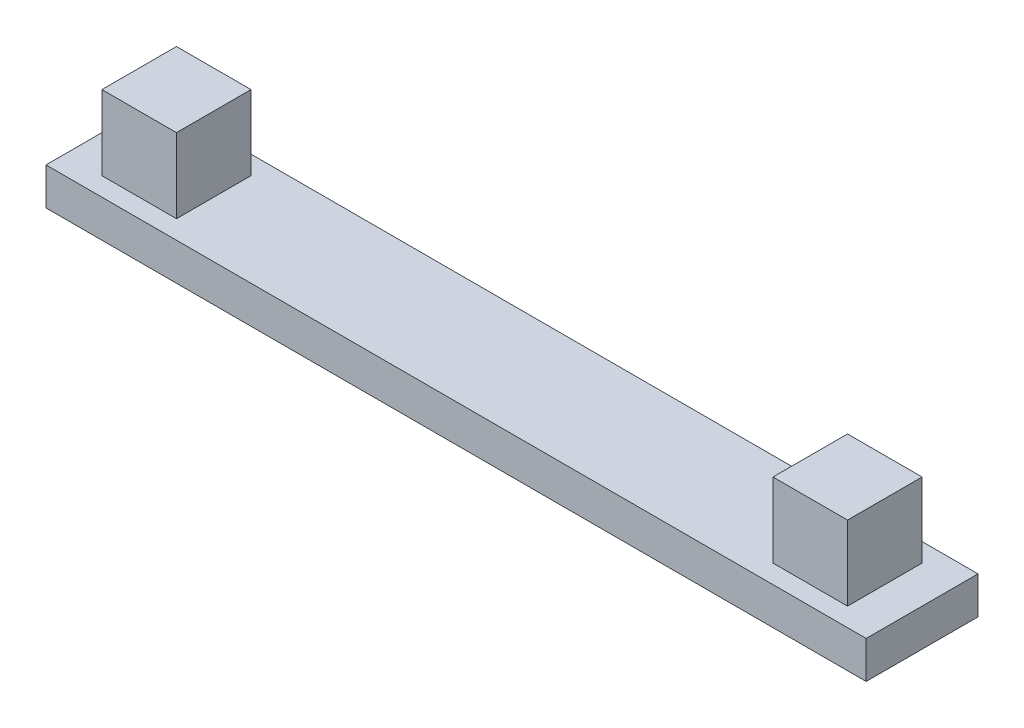
ISO-10303-21;
HEADER;
FILE_DESCRIPTION(('STEP AP214'),'2;1');
FILE_NAME('part.step','',(''),(''),'','','');
FILE_SCHEMA(('AUTOMOTIVE_DESIGN { 1 0 10303 214 1 1 1 1 }'));
ENDSEC;
DATA;
#1=APPLICATION_CONTEXT('core data for automotive mechanical design processes');
#2=APPLICATION_PROTOCOL_DEFINITION('international standard','automotive_design',2000,#1);
#3=PRODUCT_CONTEXT('',#1,'mechanical');
#4=PRODUCT('Part','Part','',(#3));
#5=PRODUCT_RELATED_PRODUCT_CATEGORY('part','',(#4));
#6=PRODUCT_DEFINITION_FORMATION('','',#4);
#7=PRODUCT_DEFINITION_CONTEXT('part definition',#1,'design');
#8=PRODUCT_DEFINITION('design','',#6,#7);
#9=PRODUCT_DEFINITION_SHAPE('','',#8);
#10=(LENGTH_UNIT() NAMED_UNIT(*) SI_UNIT(.MILLI.,.METRE.));
#11=(NAMED_UNIT(*) PLANE_ANGLE_UNIT() SI_UNIT($,.RADIAN.));
#12=(NAMED_UNIT(*) SI_UNIT($,.STERADIAN.) SOLID_ANGLE_UNIT());
#13=UNCERTAINTY_MEASURE_WITH_UNIT(LENGTH_MEASURE(1.E-05),#10,'distance_accuracy_value','');
#14=(GEOMETRIC_REPRESENTATION_CONTEXT(3) GLOBAL_UNCERTAINTY_ASSIGNED_CONTEXT((#13)) GLOBAL_UNIT_ASSIGNED_CONTEXT((#10,
#11,#12)) REPRESENTATION_CONTEXT('',''));
#15=CARTESIAN_POINT('',(0.,0.,0.));
#16=DIRECTION('',(0.,0.,1.));
#17=DIRECTION('',(1.,0.,0.));
#18=AXIS2_PLACEMENT_3D('',#15,#16,#17);
#19=CARTESIAN_POINT('',(0.,1.,0.));
#20=DIRECTION('',(0.,0.,-1.));
#21=DIRECTION('',(-1.,0.,0.));
#22=AXIS2_PLACEMENT_3D('',#19,#20,#21);
#23=PLANE('',#22);
#24=DIRECTION('',(1.,0.,0.));
#25=VECTOR('',#24,1.);
#26=CARTESIAN_POINT('',(0.,0.,0.));
#27=LINE('',#26,#25);
#28=CARTESIAN_POINT('',(0.,0.,0.));
#29=VERTEX_POINT('',#28);
#30=CARTESIAN_POINT('',(22.,0.,0.));
#31=VERTEX_POINT('',#30);
#32=EDGE_CURVE('E136',#29,#31,#27,.T.);
#33=ORIENTED_EDGE('',*,*,#32,.T.);
#34=DIRECTION('',(0.,-1.,0.));
#35=VECTOR('',#34,1.);
#36=CARTESIAN_POINT('',(22.,1.,0.));
#37=LINE('',#36,#35);
#38=CARTESIAN_POINT('',(22.,1.,0.));
#39=VERTEX_POINT('',#38);
#40=EDGE_CURVE('E11',#39,#31,#37,.T.);
#41=ORIENTED_EDGE('',*,*,#40,.F.);
#42=DIRECTION('',(1.,0.,0.));
#43=VECTOR('',#42,1.);
#44=CARTESIAN_POINT('',(0.,1.,0.));
#45=LINE('',#44,#43);
#46=CARTESIAN_POINT('',(0.,1.,0.));
#47=VERTEX_POINT('',#46);
#48=EDGE_CURVE('E101',#47,#39,#45,.T.);
#49=ORIENTED_EDGE('',*,*,#48,.F.);
#50=DIRECTION('',(0.,-1.,0.));
#51=VECTOR('',#50,1.);
#52=CARTESIAN_POINT('',(0.,1.,0.));
#53=LINE('',#52,#51);
#54=EDGE_CURVE('E78',#47,#29,#53,.T.);
#55=ORIENTED_EDGE('',*,*,#54,.T.);
#56=EDGE_LOOP('',(#33,#41,#49,#55));
#57=FACE_BOUND('',#56,.T.);
#58=ADVANCED_FACE('F35',(#57),#23,.F.);
#59=CARTESIAN_POINT('',(22.,1.,0.));
#60=DIRECTION('',(-1.,0.,0.));
#61=DIRECTION('',(0.,0.,1.));
#62=AXIS2_PLACEMENT_3D('',#59,#60,#61);
#63=PLANE('',#62);
#64=DIRECTION('',(0.,0.,-1.));
#65=VECTOR('',#64,1.);
#66=CARTESIAN_POINT('',(22.,0.,0.));
#67=LINE('',#66,#65);
#68=CARTESIAN_POINT('',(22.,0.,-3.));
#69=VERTEX_POINT('',#68);
#70=EDGE_CURVE('E138',#31,#69,#67,.T.);
#71=ORIENTED_EDGE('',*,*,#70,.T.);
#72=DIRECTION('',(0.,-1.,0.));
#73=VECTOR('',#72,1.);
#74=CARTESIAN_POINT('',(22.,1.,-3.));
#75=LINE('',#74,#73);
#76=CARTESIAN_POINT('',(22.,1.,-3.));
#77=VERTEX_POINT('',#76);
#78=EDGE_CURVE('E43',#77,#69,#75,.T.);
#79=ORIENTED_EDGE('',*,*,#78,.F.);
#80=DIRECTION('',(0.,0.,-1.));
#81=VECTOR('',#80,1.);
#82=CARTESIAN_POINT('',(22.,1.,0.));
#83=LINE('',#82,#81);
#84=EDGE_CURVE('E86',#39,#77,#83,.T.);
#85=ORIENTED_EDGE('',*,*,#84,.F.);
#86=ORIENTED_EDGE('',*,*,#40,.T.);
#87=EDGE_LOOP('',(#71,#79,#85,#86));
#88=FACE_BOUND('',#87,.T.);
#89=ADVANCED_FACE('F148',(#88),#63,.F.);
#90=CARTESIAN_POINT('',(0.,1.,-3.));
#91=DIRECTION('',(0.,0.,-1.));
#92=DIRECTION('',(-1.,0.,0.));
#93=AXIS2_PLACEMENT_3D('',#90,#91,#92);
#94=PLANE('',#93);
#95=DIRECTION('',(1.,0.,0.));
#96=VECTOR('',#95,1.);
#97=CARTESIAN_POINT('',(0.,0.,-3.));
#98=LINE('',#97,#96);
#99=CARTESIAN_POINT('',(0.,0.,-3.));
#100=VERTEX_POINT('',#99);
#101=EDGE_CURVE('E142',#100,#69,#98,.T.);
#102=ORIENTED_EDGE('',*,*,#101,.F.);
#103=DIRECTION('',(0.,-1.,0.));
#104=VECTOR('',#103,1.);
#105=CARTESIAN_POINT('',(0.,1.,-3.));
#106=LINE('',#105,#104);
#107=CARTESIAN_POINT('',(0.,1.,-3.));
#108=VERTEX_POINT('',#107);
#109=EDGE_CURVE('E70',#108,#100,#106,.T.);
#110=ORIENTED_EDGE('',*,*,#109,.F.);
#111=DIRECTION('',(1.,0.,0.));
#112=VECTOR('',#111,1.);
#113=CARTESIAN_POINT('',(0.,1.,-3.));
#114=LINE('',#113,#112);
#115=EDGE_CURVE('E108',#108,#77,#114,.T.);
#116=ORIENTED_EDGE('',*,*,#115,.T.);
#117=ORIENTED_EDGE('',*,*,#78,.T.);
#118=EDGE_LOOP('',(#102,#110,#116,#117));
#119=FACE_BOUND('',#118,.T.);
#120=ADVANCED_FACE('F147',(#119),#94,.T.);
#121=CARTESIAN_POINT('',(0.,1.,0.));
#122=DIRECTION('',(-1.,0.,0.));
#123=DIRECTION('',(0.,0.,1.));
#124=AXIS2_PLACEMENT_3D('',#121,#122,#123);
#125=PLANE('',#124);
#126=DIRECTION('',(0.,0.,-1.));
#127=VECTOR('',#126,1.);
#128=CARTESIAN_POINT('',(0.,0.,0.));
#129=LINE('',#128,#127);
#130=EDGE_CURVE('E97',#29,#100,#129,.T.);
#131=ORIENTED_EDGE('',*,*,#130,.F.);
#132=ORIENTED_EDGE('',*,*,#54,.F.);
#133=DIRECTION('',(0.,0.,-1.));
#134=VECTOR('',#133,1.);
#135=CARTESIAN_POINT('',(0.,1.,0.));
#136=LINE('',#135,#134);
#137=EDGE_CURVE('E95',#47,#108,#136,.T.);
#138=ORIENTED_EDGE('',*,*,#137,.T.);
#139=ORIENTED_EDGE('',*,*,#109,.T.);
#140=EDGE_LOOP('',(#131,#132,#138,#139));
#141=FACE_BOUND('',#140,.T.);
#142=ADVANCED_FACE('F93',(#141),#125,.T.);
#143=CARTESIAN_POINT('',(0.,1.,0.));
#144=DIRECTION('',(0.,1.,0.));
#145=DIRECTION('',(0.,0.,1.));
#146=AXIS2_PLACEMENT_3D('',#143,#144,#145);
#147=PLANE('',#146);
#148=ORIENTED_EDGE('',*,*,#48,.T.);
#149=ORIENTED_EDGE('',*,*,#84,.T.);
#150=ORIENTED_EDGE('',*,*,#115,.F.);
#151=ORIENTED_EDGE('',*,*,#137,.F.);
#152=EDGE_LOOP('',(#148,#149,#150,#151));
#153=FACE_BOUND('',#152,.T.);
#154=DIRECTION('',(1.,0.,0.));
#155=VECTOR('',#154,1.);
#156=CARTESIAN_POINT('',(0.,1.,-2.5));
#157=LINE('',#156,#155);
#158=CARTESIAN_POINT('',(1.,1.,-2.5));
#159=VERTEX_POINT('',#158);
#160=CARTESIAN_POINT('',(3.,1.,-2.5));
#161=VERTEX_POINT('',#160);
#162=EDGE_CURVE('E109',#159,#161,#157,.T.);
#163=ORIENTED_EDGE('',*,*,#162,.T.);
#164=DIRECTION('',(0.,0.,1.));
#165=VECTOR('',#164,1.);
#166=CARTESIAN_POINT('',(3.,1.,0.));
#167=LINE('',#166,#165);
#168=CARTESIAN_POINT('',(3.,1.,-0.5));
#169=VERTEX_POINT('',#168);
#170=EDGE_CURVE('E112',#161,#169,#167,.T.);
#171=ORIENTED_EDGE('',*,*,#170,.T.);
#172=DIRECTION('',(1.,0.,0.));
#173=VECTOR('',#172,1.);
#174=CARTESIAN_POINT('',(0.,1.,-0.5));
#175=LINE('',#174,#173);
#176=CARTESIAN_POINT('',(1.,1.,-0.5));
#177=VERTEX_POINT('',#176);
#178=EDGE_CURVE('E119',#177,#169,#175,.T.);
#179=ORIENTED_EDGE('',*,*,#178,.F.);
#180=DIRECTION('',(0.,0.,1.));
#181=VECTOR('',#180,1.);
#182=CARTESIAN_POINT('',(1.,1.,0.));
#183=LINE('',#182,#181);
#184=EDGE_CURVE('E122',#159,#177,#183,.T.);
#185=ORIENTED_EDGE('',*,*,#184,.F.);
#186=EDGE_LOOP('',(#163,#171,#179,#185));
#187=FACE_BOUND('',#186,.T.);
#188=DIRECTION('',(1.,0.,0.));
#189=VECTOR('',#188,1.);
#190=CARTESIAN_POINT('',(0.,1.,-2.5));
#191=LINE('',#190,#189);
#192=CARTESIAN_POINT('',(19.,1.,-2.5));
#193=VERTEX_POINT('',#192);
#194=CARTESIAN_POINT('',(21.,1.,-2.5));
#195=VERTEX_POINT('',#194);
#196=EDGE_CURVE('E125',#193,#195,#191,.T.);
#197=ORIENTED_EDGE('',*,*,#196,.T.);
#198=DIRECTION('',(0.,0.,1.));
#199=VECTOR('',#198,1.);
#200=CARTESIAN_POINT('',(21.,1.,0.));
#201=LINE('',#200,#199);
#202=CARTESIAN_POINT('',(21.,1.,-0.500000000000003));
#203=VERTEX_POINT('',#202);
#204=EDGE_CURVE('E128',#195,#203,#201,.T.);
#205=ORIENTED_EDGE('',*,*,#204,.T.);
#206=DIRECTION('',(1.,0.,0.));
#207=VECTOR('',#206,1.);
#208=CARTESIAN_POINT('',(0.,1.,-0.500000000000003));
#209=LINE('',#208,#207);
#210=CARTESIAN_POINT('',(19.,1.,-0.500000000000003));
#211=VERTEX_POINT('',#210);
#212=EDGE_CURVE('E131',#211,#203,#209,.T.);
#213=ORIENTED_EDGE('',*,*,#212,.F.);
#214=DIRECTION('',(0.,0.,1.));
#215=VECTOR('',#214,1.);
#216=CARTESIAN_POINT('',(19.,1.,0.));
#217=LINE('',#216,#215);
#218=EDGE_CURVE('E98',#193,#211,#217,.T.);
#219=ORIENTED_EDGE('',*,*,#218,.F.);
#220=EDGE_LOOP('',(#197,#205,#213,#219));
#221=FACE_BOUND('',#220,.T.);
#222=ADVANCED_FACE('F105',(#153,#187,#221),#147,.T.);
#223=CARTESIAN_POINT('',(0.,0.,0.));
#224=DIRECTION('',(0.,1.,0.));
#225=DIRECTION('',(0.,0.,1.));
#226=AXIS2_PLACEMENT_3D('',#223,#224,#225);
#227=PLANE('',#226);
#228=ORIENTED_EDGE('',*,*,#32,.F.);
#229=ORIENTED_EDGE('',*,*,#130,.T.);
#230=ORIENTED_EDGE('',*,*,#101,.T.);
#231=ORIENTED_EDGE('',*,*,#70,.F.);
#232=EDGE_LOOP('',(#228,#229,#230,#231));
#233=FACE_BOUND('',#232,.T.);
#234=ADVANCED_FACE('F150',(#233),#227,.F.);
#235=CARTESIAN_POINT('',(1.,3.,-2.5));
#236=DIRECTION('',(1.,0.,0.));
#237=DIRECTION('',(0.,0.,-1.));
#238=AXIS2_PLACEMENT_3D('',#235,#236,#237);
#239=PLANE('',#238);
#240=ORIENTED_EDGE('',*,*,#184,.T.);
#241=DIRECTION('',(0.,-1.,0.));
#242=VECTOR('',#241,1.);
#243=CARTESIAN_POINT('',(1.,3.,-0.5));
#244=LINE('',#243,#242);
#245=CARTESIAN_POINT('',(1.,3.,-0.5));
#246=VERTEX_POINT('',#245);
#247=EDGE_CURVE('E139',#246,#177,#244,.T.);
#248=ORIENTED_EDGE('',*,*,#247,.F.);
#249=DIRECTION('',(0.,0.,1.));
#250=VECTOR('',#249,1.);
#251=CARTESIAN_POINT('',(1.,3.,-2.5));
#252=LINE('',#251,#250);
#253=CARTESIAN_POINT('',(1.,3.,-2.5));
#254=VERTEX_POINT('',#253);
#255=EDGE_CURVE('E301',#254,#246,#252,.T.);
#256=ORIENTED_EDGE('',*,*,#255,.F.);
#257=DIRECTION('',(0.,-1.,0.));
#258=VECTOR('',#257,1.);
#259=CARTESIAN_POINT('',(1.,3.,-2.5));
#260=LINE('',#259,#258);
#261=EDGE_CURVE('E332',#254,#159,#260,.T.);
#262=ORIENTED_EDGE('',*,*,#261,.T.);
#263=EDGE_LOOP('',(#240,#248,#256,#262));
#264=FACE_BOUND('',#263,.T.);
#265=ADVANCED_FACE('F152',(#264),#239,.F.);
#266=CARTESIAN_POINT('',(1.,3.,-0.5));
#267=DIRECTION('',(0.,0.,-1.));
#268=DIRECTION('',(-1.,0.,0.));
#269=AXIS2_PLACEMENT_3D('',#266,#267,#268);
#270=PLANE('',#269);
#271=ORIENTED_EDGE('',*,*,#178,.T.);
#272=DIRECTION('',(0.,-1.,0.));
#273=VECTOR('',#272,1.);
#274=CARTESIAN_POINT('',(3.,3.,-0.5));
#275=LINE('',#274,#273);
#276=CARTESIAN_POINT('',(3.,3.,-0.5));
#277=VERTEX_POINT('',#276);
#278=EDGE_CURVE('E337',#277,#169,#275,.T.);
#279=ORIENTED_EDGE('',*,*,#278,.F.);
#280=DIRECTION('',(1.,0.,0.));
#281=VECTOR('',#280,1.);
#282=CARTESIAN_POINT('',(1.,3.,-0.5));
#283=LINE('',#282,#281);
#284=EDGE_CURVE('E323',#246,#277,#283,.T.);
#285=ORIENTED_EDGE('',*,*,#284,.F.);
#286=ORIENTED_EDGE('',*,*,#247,.T.);
#287=EDGE_LOOP('',(#271,#279,#285,#286));
#288=FACE_BOUND('',#287,.T.);
#289=ADVANCED_FACE('F158',(#288),#270,.F.);
#290=CARTESIAN_POINT('',(3.,3.,-2.5));
#291=DIRECTION('',(1.,0.,0.));
#292=DIRECTION('',(0.,0.,-1.));
#293=AXIS2_PLACEMENT_3D('',#290,#291,#292);
#294=PLANE('',#293);
#295=ORIENTED_EDGE('',*,*,#278,.T.);
#296=ORIENTED_EDGE('',*,*,#170,.F.);
#297=DIRECTION('',(0.,-1.,0.));
#298=VECTOR('',#297,1.);
#299=CARTESIAN_POINT('',(3.,3.,-2.5));
#300=LINE('',#299,#298);
#301=CARTESIAN_POINT('',(3.,3.,-2.5));
#302=VERTEX_POINT('',#301);
#303=EDGE_CURVE('E335',#302,#161,#300,.T.);
#304=ORIENTED_EDGE('',*,*,#303,.F.);
#305=DIRECTION('',(0.,0.,1.));
#306=VECTOR('',#305,1.);
#307=CARTESIAN_POINT('',(3.,3.,-2.5));
#308=LINE('',#307,#306);
#309=EDGE_CURVE('E326',#302,#277,#308,.T.);
#310=ORIENTED_EDGE('',*,*,#309,.T.);
#311=EDGE_LOOP('',(#295,#296,#304,#310));
#312=FACE_BOUND('',#311,.T.);
#313=ADVANCED_FACE('F201',(#312),#294,.T.);
#314=CARTESIAN_POINT('',(1.,3.,-2.5));
#315=DIRECTION('',(0.,0.,-1.));
#316=DIRECTION('',(-1.,0.,0.));
#317=AXIS2_PLACEMENT_3D('',#314,#315,#316);
#318=PLANE('',#317);
#319=ORIENTED_EDGE('',*,*,#303,.T.);
#320=ORIENTED_EDGE('',*,*,#162,.F.);
#321=ORIENTED_EDGE('',*,*,#261,.F.);
#322=DIRECTION('',(1.,0.,0.));
#323=VECTOR('',#322,1.);
#324=CARTESIAN_POINT('',(1.,3.,-2.5));
#325=LINE('',#324,#323);
#326=EDGE_CURVE('E329',#254,#302,#325,.T.);
#327=ORIENTED_EDGE('',*,*,#326,.T.);
#328=EDGE_LOOP('',(#319,#320,#321,#327));
#329=FACE_BOUND('',#328,.T.);
#330=ADVANCED_FACE('F211',(#329),#318,.T.);
#331=CARTESIAN_POINT('',(0.,3.,0.));
#332=DIRECTION('',(0.,1.,0.));
#333=DIRECTION('',(0.,0.,1.));
#334=AXIS2_PLACEMENT_3D('',#331,#332,#333);
#335=PLANE('',#334);
#336=ORIENTED_EDGE('',*,*,#255,.T.);
#337=ORIENTED_EDGE('',*,*,#284,.T.);
#338=ORIENTED_EDGE('',*,*,#309,.F.);
#339=ORIENTED_EDGE('',*,*,#326,.F.);
#340=EDGE_LOOP('',(#336,#337,#338,#339));
#341=FACE_BOUND('',#340,.T.);
#342=ADVANCED_FACE('F221',(#341),#335,.T.);
#343=CARTESIAN_POINT('',(19.,3.,-2.5));
#344=DIRECTION('',(1.,0.,0.));
#345=DIRECTION('',(0.,0.,-1.));
#346=AXIS2_PLACEMENT_3D('',#343,#344,#345);
#347=PLANE('',#346);
#348=ORIENTED_EDGE('',*,*,#218,.T.);
#349=DIRECTION('',(0.,-1.,0.));
#350=VECTOR('',#349,1.);
#351=CARTESIAN_POINT('',(19.,3.,-0.500000000000003));
#352=LINE('',#351,#350);
#353=CARTESIAN_POINT('',(19.,3.,-0.500000000000003));
#354=VERTEX_POINT('',#353);
#355=EDGE_CURVE('E304',#354,#211,#352,.T.);
#356=ORIENTED_EDGE('',*,*,#355,.F.);
#357=DIRECTION('',(0.,0.,1.));
#358=VECTOR('',#357,1.);
#359=CARTESIAN_POINT('',(19.,3.,-2.5));
#360=LINE('',#359,#358);
#361=CARTESIAN_POINT('',(19.,3.,-2.5));
#362=VERTEX_POINT('',#361);
#363=EDGE_CURVE('E289',#362,#354,#360,.T.);
#364=ORIENTED_EDGE('',*,*,#363,.F.);
#365=DIRECTION('',(0.,-1.,0.));
#366=VECTOR('',#365,1.);
#367=CARTESIAN_POINT('',(19.,3.,-2.5));
#368=LINE('',#367,#366);
#369=EDGE_CURVE('E314',#362,#193,#368,.T.);
#370=ORIENTED_EDGE('',*,*,#369,.T.);
#371=EDGE_LOOP('',(#348,#356,#364,#370));
#372=FACE_BOUND('',#371,.T.);
#373=ADVANCED_FACE('F231',(#372),#347,.F.);
#374=CARTESIAN_POINT('',(19.,3.,-0.500000000000003));
#375=DIRECTION('',(0.,0.,-1.));
#376=DIRECTION('',(-1.,0.,0.));
#377=AXIS2_PLACEMENT_3D('',#374,#375,#376);
#378=PLANE('',#377);
#379=ORIENTED_EDGE('',*,*,#212,.T.);
#380=DIRECTION('',(0.,-1.,0.));
#381=VECTOR('',#380,1.);
#382=CARTESIAN_POINT('',(21.,3.,-0.500000000000003));
#383=LINE('',#382,#381);
#384=CARTESIAN_POINT('',(21.,3.,-0.500000000000003));
#385=VERTEX_POINT('',#384);
#386=EDGE_CURVE('E308',#385,#203,#383,.T.);
#387=ORIENTED_EDGE('',*,*,#386,.F.);
#388=DIRECTION('',(1.,0.,0.));
#389=VECTOR('',#388,1.);
#390=CARTESIAN_POINT('',(19.,3.,-0.500000000000003));
#391=LINE('',#390,#389);
#392=EDGE_CURVE('E294',#354,#385,#391,.T.);
#393=ORIENTED_EDGE('',*,*,#392,.F.);
#394=ORIENTED_EDGE('',*,*,#355,.T.);
#395=EDGE_LOOP('',(#379,#387,#393,#394));
#396=FACE_BOUND('',#395,.T.);
#397=ADVANCED_FACE('F241',(#396),#378,.F.);
#398=CARTESIAN_POINT('',(21.,3.,-2.5));
#399=DIRECTION('',(1.,0.,0.));
#400=DIRECTION('',(0.,0.,-1.));
#401=AXIS2_PLACEMENT_3D('',#398,#399,#400);
#402=PLANE('',#401);
#403=ORIENTED_EDGE('',*,*,#386,.T.);
#404=ORIENTED_EDGE('',*,*,#204,.F.);
#405=DIRECTION('',(0.,-1.,0.));
#406=VECTOR('',#405,1.);
#407=CARTESIAN_POINT('',(21.,3.,-2.5));
#408=LINE('',#407,#406);
#409=CARTESIAN_POINT('',(21.,3.,-2.5));
#410=VERTEX_POINT('',#409);
#411=EDGE_CURVE('E51',#410,#195,#408,.T.);
#412=ORIENTED_EDGE('',*,*,#411,.F.);
#413=DIRECTION('',(0.,0.,1.));
#414=VECTOR('',#413,1.);
#415=CARTESIAN_POINT('',(21.,3.,-2.5));
#416=LINE('',#415,#414);
#417=EDGE_CURVE('E317',#410,#385,#416,.T.);
#418=ORIENTED_EDGE('',*,*,#417,.T.);
#419=EDGE_LOOP('',(#403,#404,#412,#418));
#420=FACE_BOUND('',#419,.T.);
#421=ADVANCED_FACE('F251',(#420),#402,.T.);
#422=CARTESIAN_POINT('',(19.,3.,-2.5));
#423=DIRECTION('',(0.,0.,-1.));
#424=DIRECTION('',(-1.,0.,0.));
#425=AXIS2_PLACEMENT_3D('',#422,#423,#424);
#426=PLANE('',#425);
#427=ORIENTED_EDGE('',*,*,#411,.T.);
#428=ORIENTED_EDGE('',*,*,#196,.F.);
#429=ORIENTED_EDGE('',*,*,#369,.F.);
#430=DIRECTION('',(1.,0.,0.));
#431=VECTOR('',#430,1.);
#432=CARTESIAN_POINT('',(19.,3.,-2.5));
#433=LINE('',#432,#431);
#434=EDGE_CURVE('E297',#362,#410,#433,.T.);
#435=ORIENTED_EDGE('',*,*,#434,.T.);
#436=EDGE_LOOP('',(#427,#428,#429,#435));
#437=FACE_BOUND('',#436,.T.);
#438=ADVANCED_FACE('F261',(#437),#426,.T.);
#439=CARTESIAN_POINT('',(0.,3.,0.));
#440=DIRECTION('',(0.,1.,0.));
#441=DIRECTION('',(0.,0.,1.));
#442=AXIS2_PLACEMENT_3D('',#439,#440,#441);
#443=PLANE('',#442);
#444=ORIENTED_EDGE('',*,*,#363,.T.);
#445=ORIENTED_EDGE('',*,*,#392,.T.);
#446=ORIENTED_EDGE('',*,*,#417,.F.);
#447=ORIENTED_EDGE('',*,*,#434,.F.);
#448=EDGE_LOOP('',(#444,#445,#446,#447));
#449=FACE_BOUND('',#448,.T.);
#450=ADVANCED_FACE('F271',(#449),#443,.T.);
#451=CLOSED_SHELL('',(#58,#89,#120,#142,#222,#234,#265,#289,#313,#330,#342,#373,#397,#421,#438,#450));
#452=MANIFOLD_SOLID_BREP('B2',#451);
#453=ADVANCED_BREP_SHAPE_REPRESENTATION('',(#18,#452),#14);
#454=SHAPE_DEFINITION_REPRESENTATION(#9,#453);
ENDSEC;
END-ISO-10303-21;
